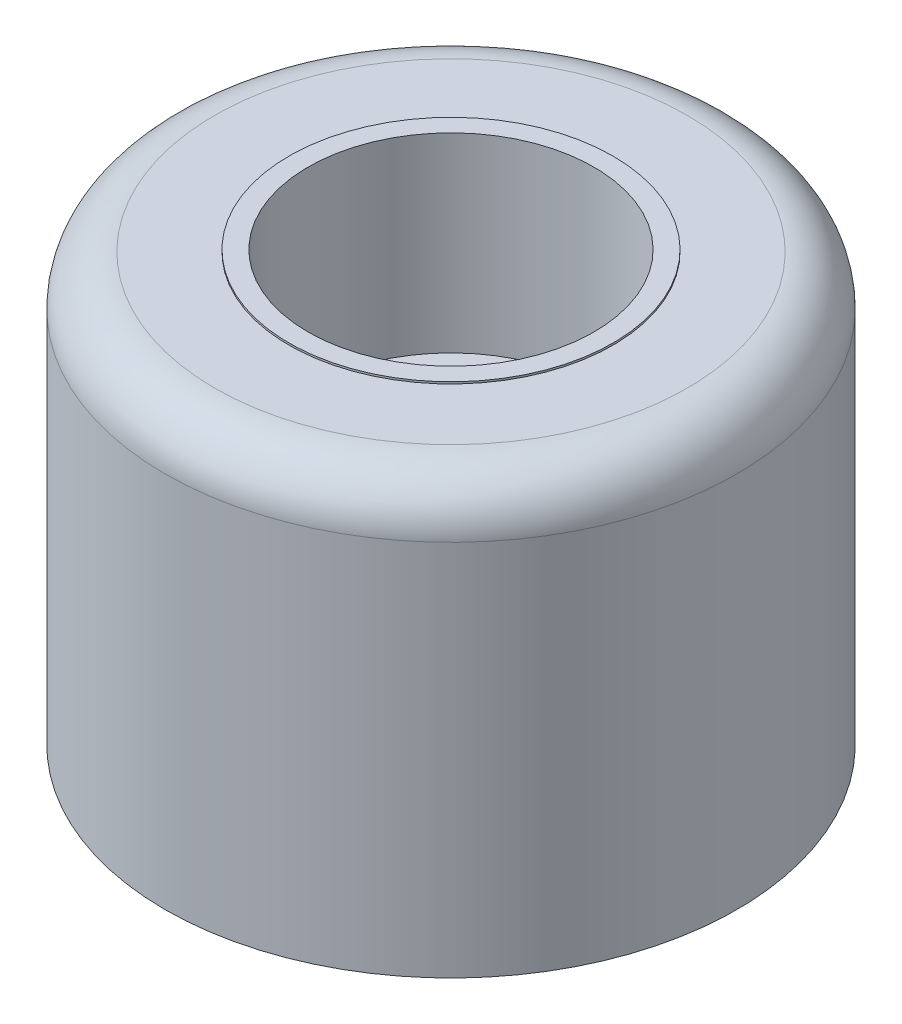
ISO-10303-21;
HEADER;
FILE_DESCRIPTION(('STEP AP214'),'2;1');
FILE_NAME('part.step','',(''),(''),'','','');
FILE_SCHEMA(('AUTOMOTIVE_DESIGN { 1 0 10303 214 1 1 1 1 }'));
ENDSEC;
DATA;
#1=APPLICATION_CONTEXT('core data for automotive mechanical design processes');
#2=APPLICATION_PROTOCOL_DEFINITION('international standard','automotive_design',2000,#1);
#3=PRODUCT_CONTEXT('',#1,'mechanical');
#4=PRODUCT('Part','Part','',(#3));
#5=PRODUCT_RELATED_PRODUCT_CATEGORY('part','',(#4));
#6=PRODUCT_DEFINITION_FORMATION('','',#4);
#7=PRODUCT_DEFINITION_CONTEXT('part definition',#1,'design');
#8=PRODUCT_DEFINITION('design','',#6,#7);
#9=PRODUCT_DEFINITION_SHAPE('','',#8);
#10=(LENGTH_UNIT() NAMED_UNIT(*) SI_UNIT(.MILLI.,.METRE.));
#11=(NAMED_UNIT(*) PLANE_ANGLE_UNIT() SI_UNIT($,.RADIAN.));
#12=(NAMED_UNIT(*) SI_UNIT($,.STERADIAN.) SOLID_ANGLE_UNIT());
#13=UNCERTAINTY_MEASURE_WITH_UNIT(LENGTH_MEASURE(1.E-05),#10,'distance_accuracy_value','');
#14=(GEOMETRIC_REPRESENTATION_CONTEXT(3) GLOBAL_UNCERTAINTY_ASSIGNED_CONTEXT((#13)) GLOBAL_UNIT_ASSIGNED_CONTEXT((#10,
#11,#12)) REPRESENTATION_CONTEXT('',''));
#15=CARTESIAN_POINT('',(0.,0.,0.));
#16=DIRECTION('',(0.,0.,1.));
#17=DIRECTION('',(1.,0.,0.));
#18=AXIS2_PLACEMENT_3D('',#15,#16,#17);
#19=CARTESIAN_POINT('',(0.,6.35,0.));
#20=DIRECTION('',(0.,1.,0.));
#21=DIRECTION('',(0.,0.,1.));
#22=AXIS2_PLACEMENT_3D('',#19,#20,#21);
#23=PLANE('',#22);
#24=CARTESIAN_POINT('',(0.,6.35,0.));
#25=DIRECTION('',(0.,1.,0.));
#26=DIRECTION('',(0.,0.,1.));
#27=AXIS2_PLACEMENT_3D('',#24,#25,#26);
#28=CIRCLE('',#27,4.7625);
#29=CARTESIAN_POINT('',(0.,6.35,4.7625));
#30=VERTEX_POINT('',#29);
#31=EDGE_CURVE('E50',#30,#30,#28,.T.);
#32=ORIENTED_EDGE('',*,*,#31,.F.);
#33=EDGE_LOOP('',(#32));
#34=FACE_BOUND('',#33,.T.);
#35=CARTESIAN_POINT('',(0.,6.35,0.));
#36=DIRECTION('',(0.,-1.,0.));
#37=DIRECTION('',(0.,0.,-1.));
#38=AXIS2_PLACEMENT_3D('',#35,#36,#37);
#39=CIRCLE('',#38,5.3975);
#40=CARTESIAN_POINT('',(0.,6.35,-5.3975));
#41=VERTEX_POINT('',#40);
#42=EDGE_CURVE('E62',#41,#41,#39,.T.);
#43=ORIENTED_EDGE('',*,*,#42,.F.);
#44=EDGE_LOOP('',(#43));
#45=FACE_BOUND('',#44,.T.);
#46=ADVANCED_FACE('F30',(#34,#45),#23,.T.);
#47=CARTESIAN_POINT('',(0.,6.35,0.));
#48=DIRECTION('',(0.,-1.,0.));
#49=DIRECTION('',(0.,0.,-1.));
#50=AXIS2_PLACEMENT_3D('',#47,#48,#49);
#51=CYLINDRICAL_SURFACE('',#50,9.525);
#52=CARTESIAN_POINT('',(0.,4.6355,0.));
#53=DIRECTION('',(0.,1.,0.));
#54=DIRECTION('',(0.,0.,1.));
#55=AXIS2_PLACEMENT_3D('',#52,#53,#54);
#56=CIRCLE('',#55,9.525);
#57=CARTESIAN_POINT('',(0.,4.6355,9.525));
#58=VERTEX_POINT('',#57);
#59=EDGE_CURVE('E37',#58,#58,#56,.F.);
#60=ORIENTED_EDGE('',*,*,#59,.T.);
#61=EDGE_LOOP('',(#60));
#62=FACE_BOUND('',#61,.T.);
#63=CARTESIAN_POINT('',(0.,-7.9375,0.));
#64=DIRECTION('',(0.,1.,0.));
#65=DIRECTION('',(0.,0.,1.));
#66=AXIS2_PLACEMENT_3D('',#63,#64,#65);
#67=CIRCLE('',#66,9.525);
#68=CARTESIAN_POINT('',(0.,-7.9375,9.525));
#69=VERTEX_POINT('',#68);
#70=EDGE_CURVE('E41',#69,#69,#67,.T.);
#71=ORIENTED_EDGE('',*,*,#70,.T.);
#72=EDGE_LOOP('',(#71));
#73=FACE_BOUND('',#72,.T.);
#74=ADVANCED_FACE('F70',(#62,#73),#51,.T.);
#75=CARTESIAN_POINT('',(0.,6.35,0.));
#76=DIRECTION('',(0.,-1.,0.));
#77=DIRECTION('',(0.,0.,-1.));
#78=AXIS2_PLACEMENT_3D('',#75,#76,#77);
#79=CYLINDRICAL_SURFACE('',#78,2.38125);
#80=CARTESIAN_POINT('',(0.,-7.9375,0.));
#81=DIRECTION('',(0.,1.,0.));
#82=DIRECTION('',(0.,0.,1.));
#83=AXIS2_PLACEMENT_3D('',#80,#81,#82);
#84=CIRCLE('',#83,2.38125);
#85=CARTESIAN_POINT('',(0.,-7.9375,2.38125));
#86=VERTEX_POINT('',#85);
#87=EDGE_CURVE('E45',#86,#86,#84,.T.);
#88=ORIENTED_EDGE('',*,*,#87,.F.);
#89=EDGE_LOOP('',(#88));
#90=FACE_BOUND('',#89,.T.);
#91=CARTESIAN_POINT('',(0.,0.,0.));
#92=DIRECTION('',(0.,1.,0.));
#93=DIRECTION('',(0.,0.,1.));
#94=AXIS2_PLACEMENT_3D('',#91,#92,#93);
#95=CIRCLE('',#94,2.38125);
#96=CARTESIAN_POINT('',(0.,0.,2.38125));
#97=VERTEX_POINT('',#96);
#98=EDGE_CURVE('E48',#97,#97,#95,.T.);
#99=ORIENTED_EDGE('',*,*,#98,.T.);
#100=EDGE_LOOP('',(#99));
#101=FACE_BOUND('',#100,.T.);
#102=ADVANCED_FACE('F76',(#90,#101),#79,.F.);
#103=CARTESIAN_POINT('',(0.,-7.9375,0.));
#104=DIRECTION('',(0.,1.,0.));
#105=DIRECTION('',(0.,0.,1.));
#106=AXIS2_PLACEMENT_3D('',#103,#104,#105);
#107=PLANE('',#106);
#108=ORIENTED_EDGE('',*,*,#87,.T.);
#109=EDGE_LOOP('',(#108));
#110=FACE_BOUND('',#109,.T.);
#111=ORIENTED_EDGE('',*,*,#70,.F.);
#112=EDGE_LOOP('',(#111));
#113=FACE_BOUND('',#112,.T.);
#114=ADVANCED_FACE('F81',(#110,#113),#107,.F.);
#115=CARTESIAN_POINT('',(0.,19.8203841816037,0.));
#116=DIRECTION('',(0.,-1.,0.));
#117=DIRECTION('',(0.,0.,-1.));
#118=AXIS2_PLACEMENT_3D('',#115,#116,#117);
#119=CYLINDRICAL_SURFACE('',#118,4.7625);
#120=CARTESIAN_POINT('',(0.,0.,0.));
#121=DIRECTION('',(0.,1.,0.));
#122=DIRECTION('',(0.,0.,1.));
#123=AXIS2_PLACEMENT_3D('',#120,#121,#122);
#124=CIRCLE('',#123,4.7625);
#125=CARTESIAN_POINT('',(0.,0.,4.7625));
#126=VERTEX_POINT('',#125);
#127=EDGE_CURVE('E56',#126,#126,#124,.T.);
#128=ORIENTED_EDGE('',*,*,#127,.F.);
#129=EDGE_LOOP('',(#128));
#130=FACE_BOUND('',#129,.T.);
#131=ORIENTED_EDGE('',*,*,#31,.T.);
#132=EDGE_LOOP('',(#131));
#133=FACE_BOUND('',#132,.T.);
#134=ADVANCED_FACE('F85',(#130,#133),#119,.F.);
#135=CARTESIAN_POINT('',(0.,0.,0.));
#136=DIRECTION('',(0.,1.,0.));
#137=DIRECTION('',(0.,0.,1.));
#138=AXIS2_PLACEMENT_3D('',#135,#136,#137);
#139=PLANE('',#138);
#140=ORIENTED_EDGE('',*,*,#98,.F.);
#141=EDGE_LOOP('',(#140));
#142=FACE_BOUND('',#141,.T.);
#143=ORIENTED_EDGE('',*,*,#127,.T.);
#144=EDGE_LOOP('',(#143));
#145=FACE_BOUND('',#144,.T.);
#146=ADVANCED_FACE('F89',(#142,#145),#139,.T.);
#147=CARTESIAN_POINT('',(-9.525,6.2865,0.));
#148=DIRECTION('',(0.,1.,0.));
#149=DIRECTION('',(0.,0.,1.));
#150=AXIS2_PLACEMENT_3D('',#147,#148,#149);
#151=PLANE('',#150);
#152=CARTESIAN_POINT('',(0.,6.2865,0.));
#153=DIRECTION('',(0.,1.,0.));
#154=DIRECTION('',(0.,0.,1.));
#155=AXIS2_PLACEMENT_3D('',#152,#153,#154);
#156=CIRCLE('',#155,7.874);
#157=CARTESIAN_POINT('',(0.,6.2865,7.874));
#158=VERTEX_POINT('',#157);
#159=EDGE_CURVE('E10',#158,#158,#156,.T.);
#160=ORIENTED_EDGE('',*,*,#159,.T.);
#161=EDGE_LOOP('',(#160));
#162=FACE_BOUND('',#161,.T.);
#163=CARTESIAN_POINT('',(0.,6.2865,0.));
#164=DIRECTION('',(0.,-1.,0.));
#165=DIRECTION('',(0.,0.,-1.));
#166=AXIS2_PLACEMENT_3D('',#163,#164,#165);
#167=CIRCLE('',#166,5.3975);
#168=CARTESIAN_POINT('',(0.,6.2865,-5.3975));
#169=VERTEX_POINT('',#168);
#170=EDGE_CURVE('E59',#169,#169,#167,.T.);
#171=ORIENTED_EDGE('',*,*,#170,.T.);
#172=EDGE_LOOP('',(#171));
#173=FACE_BOUND('',#172,.T.);
#174=ADVANCED_FACE('F93',(#162,#173),#151,.T.);
#175=CARTESIAN_POINT('',(0.,-7.9375,0.));
#176=DIRECTION('',(0.,-1.,0.));
#177=DIRECTION('',(0.,0.,-1.));
#178=AXIS2_PLACEMENT_3D('',#175,#176,#177);
#179=CYLINDRICAL_SURFACE('',#178,5.3975);
#180=ORIENTED_EDGE('',*,*,#42,.T.);
#181=EDGE_LOOP('',(#180));
#182=FACE_BOUND('',#181,.T.);
#183=ORIENTED_EDGE('',*,*,#170,.F.);
#184=EDGE_LOOP('',(#183));
#185=FACE_BOUND('',#184,.T.);
#186=ADVANCED_FACE('F66',(#182,#185),#179,.T.);
#187=CARTESIAN_POINT('',(0.,4.6355,0.));
#188=DIRECTION('',(0.,1.,0.));
#189=DIRECTION('',(0.,0.,1.));
#190=AXIS2_PLACEMENT_3D('',#187,#188,#189);
#191=TOROIDAL_SURFACE('',#190,7.874,1.651);
#192=ORIENTED_EDGE('',*,*,#159,.F.);
#193=EDGE_LOOP('',(#192));
#194=FACE_BOUND('',#193,.T.);
#195=ORIENTED_EDGE('',*,*,#59,.F.);
#196=EDGE_LOOP('',(#195));
#197=FACE_BOUND('',#196,.T.);
#198=ADVANCED_FACE('F32',(#194,#197),#191,.T.);
#199=CLOSED_SHELL('',(#46,#74,#102,#114,#134,#146,#174,#186,#198));
#200=MANIFOLD_SOLID_BREP('B2',#199);
#201=ADVANCED_BREP_SHAPE_REPRESENTATION('',(#18,#200),#14);
#202=SHAPE_DEFINITION_REPRESENTATION(#9,#201);
ENDSEC;
END-ISO-10303-21;
